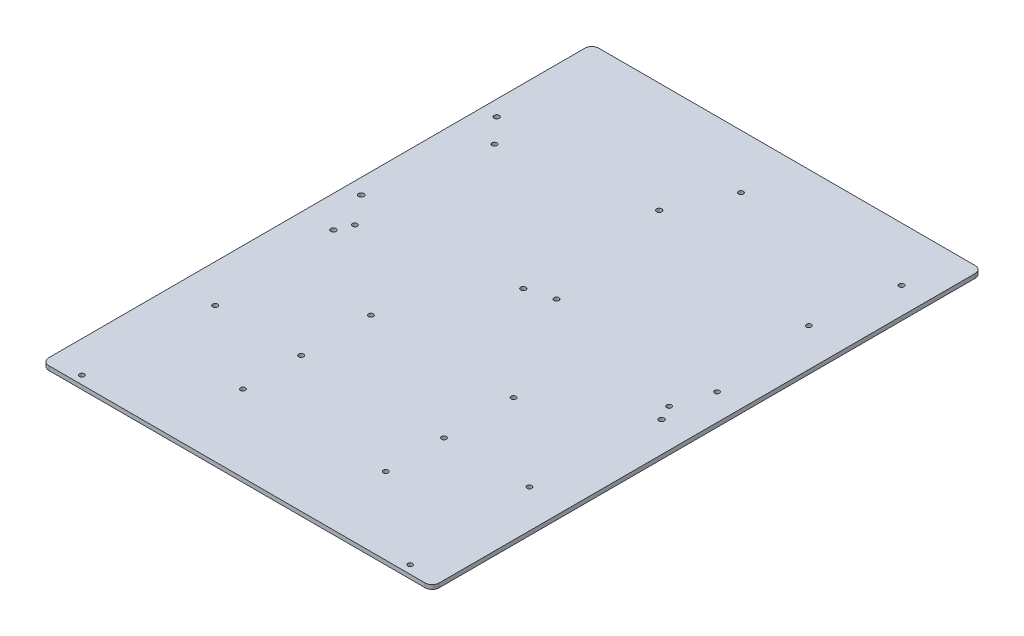
ISO-10303-21;
HEADER;
FILE_DESCRIPTION(('STEP AP214'),'2;1');
FILE_NAME('part.step','',(''),(''),'','','');
FILE_SCHEMA(('AUTOMOTIVE_DESIGN { 1 0 10303 214 1 1 1 1 }'));
ENDSEC;
DATA;
#1=APPLICATION_CONTEXT('core data for automotive mechanical design processes');
#2=APPLICATION_PROTOCOL_DEFINITION('international standard','automotive_design',2000,#1);
#3=PRODUCT_CONTEXT('',#1,'mechanical');
#4=PRODUCT('Part','Part','',(#3));
#5=PRODUCT_RELATED_PRODUCT_CATEGORY('part','',(#4));
#6=PRODUCT_DEFINITION_FORMATION('','',#4);
#7=PRODUCT_DEFINITION_CONTEXT('part definition',#1,'design');
#8=PRODUCT_DEFINITION('design','',#6,#7);
#9=PRODUCT_DEFINITION_SHAPE('','',#8);
#10=(LENGTH_UNIT() NAMED_UNIT(*) SI_UNIT(.MILLI.,.METRE.));
#11=(NAMED_UNIT(*) PLANE_ANGLE_UNIT() SI_UNIT($,.RADIAN.));
#12=(NAMED_UNIT(*) SI_UNIT($,.STERADIAN.) SOLID_ANGLE_UNIT());
#13=UNCERTAINTY_MEASURE_WITH_UNIT(LENGTH_MEASURE(1.E-05),#10,'distance_accuracy_value','');
#14=(GEOMETRIC_REPRESENTATION_CONTEXT(3) GLOBAL_UNCERTAINTY_ASSIGNED_CONTEXT((#13)) GLOBAL_UNIT_ASSIGNED_CONTEXT((#10,
#11,#12)) REPRESENTATION_CONTEXT('',''));
#15=CARTESIAN_POINT('',(0.,0.,0.));
#16=DIRECTION('',(0.,0.,1.));
#17=DIRECTION('',(1.,0.,0.));
#18=AXIS2_PLACEMENT_3D('',#15,#16,#17);
#19=CARTESIAN_POINT('',(139.7,3.,-196.85));
#20=DIRECTION('',(-1.,0.,0.));
#21=DIRECTION('',(0.,0.,1.));
#22=AXIS2_PLACEMENT_3D('',#19,#20,#21);
#23=PLANE('',#22);
#24=DIRECTION('',(0.,0.,-1.));
#25=VECTOR('',#24,1.);
#26=CARTESIAN_POINT('',(139.7,0.,-196.85));
#27=LINE('',#26,#25);
#28=CARTESIAN_POINT('',(139.7,0.,191.85));
#29=VERTEX_POINT('',#28);
#30=CARTESIAN_POINT('',(139.7,0.,-191.85));
#31=VERTEX_POINT('',#30);
#32=EDGE_CURVE('E130',#29,#31,#27,.T.);
#33=ORIENTED_EDGE('',*,*,#32,.T.);
#34=DIRECTION('',(0.,-1.,0.));
#35=VECTOR('',#34,1.);
#36=CARTESIAN_POINT('',(139.7,3.,-191.85));
#37=LINE('',#36,#35);
#38=CARTESIAN_POINT('',(139.7,3.,-191.85));
#39=VERTEX_POINT('',#38);
#40=EDGE_CURVE('E152',#31,#39,#37,.F.);
#41=ORIENTED_EDGE('',*,*,#40,.T.);
#42=DIRECTION('',(0.,0.,-1.));
#43=VECTOR('',#42,1.);
#44=CARTESIAN_POINT('',(139.7,3.,-196.85));
#45=LINE('',#44,#43);
#46=CARTESIAN_POINT('',(139.7,3.,191.85));
#47=VERTEX_POINT('',#46);
#48=EDGE_CURVE('E128',#47,#39,#45,.T.);
#49=ORIENTED_EDGE('',*,*,#48,.F.);
#50=DIRECTION('',(0.,-1.,0.));
#51=VECTOR('',#50,1.);
#52=CARTESIAN_POINT('',(139.7,3.,191.85));
#53=LINE('',#52,#51);
#54=EDGE_CURVE('E149',#47,#29,#53,.T.);
#55=ORIENTED_EDGE('',*,*,#54,.T.);
#56=EDGE_LOOP('',(#33,#41,#49,#55));
#57=FACE_BOUND('',#56,.T.);
#58=ADVANCED_FACE('F33',(#57),#23,.F.);
#59=CARTESIAN_POINT('',(-139.7,3.,-196.85));
#60=DIRECTION('',(0.,0.,1.));
#61=DIRECTION('',(1.,0.,0.));
#62=AXIS2_PLACEMENT_3D('',#59,#60,#61);
#63=PLANE('',#62);
#64=DIRECTION('',(-1.,0.,0.));
#65=VECTOR('',#64,1.);
#66=CARTESIAN_POINT('',(-139.7,0.,-196.85));
#67=LINE('',#66,#65);
#68=CARTESIAN_POINT('',(134.7,0.,-196.85));
#69=VERTEX_POINT('',#68);
#70=CARTESIAN_POINT('',(-134.7,0.,-196.85));
#71=VERTEX_POINT('',#70);
#72=EDGE_CURVE('E126',#69,#71,#67,.T.);
#73=ORIENTED_EDGE('',*,*,#72,.T.);
#74=DIRECTION('',(0.,-1.,0.));
#75=VECTOR('',#74,1.);
#76=CARTESIAN_POINT('',(-134.7,3.,-196.85));
#77=LINE('',#76,#75);
#78=CARTESIAN_POINT('',(-134.7,3.,-196.85));
#79=VERTEX_POINT('',#78);
#80=EDGE_CURVE('E104',#71,#79,#77,.F.);
#81=ORIENTED_EDGE('',*,*,#80,.T.);
#82=DIRECTION('',(-1.,0.,0.));
#83=VECTOR('',#82,1.);
#84=CARTESIAN_POINT('',(-139.7,3.,-196.85));
#85=LINE('',#84,#83);
#86=CARTESIAN_POINT('',(134.7,3.,-196.85));
#87=VERTEX_POINT('',#86);
#88=EDGE_CURVE('E166',#87,#79,#85,.T.);
#89=ORIENTED_EDGE('',*,*,#88,.F.);
#90=DIRECTION('',(0.,-1.,0.));
#91=VECTOR('',#90,1.);
#92=CARTESIAN_POINT('',(134.7,3.,-196.85));
#93=LINE('',#92,#91);
#94=EDGE_CURVE('E109',#87,#69,#93,.T.);
#95=ORIENTED_EDGE('',*,*,#94,.T.);
#96=EDGE_LOOP('',(#73,#81,#89,#95));
#97=FACE_BOUND('',#96,.T.);
#98=ADVANCED_FACE('F171',(#97),#63,.F.);
#99=CARTESIAN_POINT('',(-139.7,3.,-196.85));
#100=DIRECTION('',(1.,0.,0.));
#101=DIRECTION('',(0.,0.,-1.));
#102=AXIS2_PLACEMENT_3D('',#99,#100,#101);
#103=PLANE('',#102);
#104=DIRECTION('',(0.,0.,1.));
#105=VECTOR('',#104,1.);
#106=CARTESIAN_POINT('',(-139.7,3.,-196.85));
#107=LINE('',#106,#105);
#108=CARTESIAN_POINT('',(-139.7,3.,-191.85));
#109=VERTEX_POINT('',#108);
#110=CARTESIAN_POINT('',(-139.7,3.,191.85));
#111=VERTEX_POINT('',#110);
#112=EDGE_CURVE('E118',#109,#111,#107,.T.);
#113=ORIENTED_EDGE('',*,*,#112,.F.);
#114=DIRECTION('',(0.,-1.,0.));
#115=VECTOR('',#114,1.);
#116=CARTESIAN_POINT('',(-139.7,3.,-191.85));
#117=LINE('',#116,#115);
#118=CARTESIAN_POINT('',(-139.7,0.,-191.85));
#119=VERTEX_POINT('',#118);
#120=EDGE_CURVE('E103',#109,#119,#117,.T.);
#121=ORIENTED_EDGE('',*,*,#120,.T.);
#122=DIRECTION('',(0.,0.,1.));
#123=VECTOR('',#122,1.);
#124=CARTESIAN_POINT('',(-139.7,0.,-196.85));
#125=LINE('',#124,#123);
#126=CARTESIAN_POINT('',(-139.7,0.,191.85));
#127=VERTEX_POINT('',#126);
#128=EDGE_CURVE('E116',#119,#127,#125,.T.);
#129=ORIENTED_EDGE('',*,*,#128,.T.);
#130=DIRECTION('',(0.,-1.,0.));
#131=VECTOR('',#130,1.);
#132=CARTESIAN_POINT('',(-139.7,3.,191.85));
#133=LINE('',#132,#131);
#134=EDGE_CURVE('E120',#127,#111,#133,.F.);
#135=ORIENTED_EDGE('',*,*,#134,.T.);
#136=EDGE_LOOP('',(#113,#121,#129,#135));
#137=FACE_BOUND('',#136,.T.);
#138=ADVANCED_FACE('F115',(#137),#103,.F.);
#139=CARTESIAN_POINT('',(-139.7,3.,196.85));
#140=DIRECTION('',(0.,0.,-1.));
#141=DIRECTION('',(-1.,0.,0.));
#142=AXIS2_PLACEMENT_3D('',#139,#140,#141);
#143=PLANE('',#142);
#144=DIRECTION('',(1.,0.,0.));
#145=VECTOR('',#144,1.);
#146=CARTESIAN_POINT('',(-139.7,3.,196.85));
#147=LINE('',#146,#145);
#148=CARTESIAN_POINT('',(-134.7,3.,196.85));
#149=VERTEX_POINT('',#148);
#150=CARTESIAN_POINT('',(134.7,3.,196.85));
#151=VERTEX_POINT('',#150);
#152=EDGE_CURVE('E134',#149,#151,#147,.T.);
#153=ORIENTED_EDGE('',*,*,#152,.F.);
#154=DIRECTION('',(0.,-1.,0.));
#155=VECTOR('',#154,1.);
#156=CARTESIAN_POINT('',(-134.7,3.,196.85));
#157=LINE('',#156,#155);
#158=CARTESIAN_POINT('',(-134.7,0.,196.85));
#159=VERTEX_POINT('',#158);
#160=EDGE_CURVE('E11',#149,#159,#157,.T.);
#161=ORIENTED_EDGE('',*,*,#160,.T.);
#162=DIRECTION('',(1.,0.,0.));
#163=VECTOR('',#162,1.);
#164=CARTESIAN_POINT('',(-139.7,0.,196.85));
#165=LINE('',#164,#163);
#166=CARTESIAN_POINT('',(134.7,0.,196.85));
#167=VERTEX_POINT('',#166);
#168=EDGE_CURVE('E125',#159,#167,#165,.T.);
#169=ORIENTED_EDGE('',*,*,#168,.T.);
#170=DIRECTION('',(0.,-1.,0.));
#171=VECTOR('',#170,1.);
#172=CARTESIAN_POINT('',(134.7,3.,196.85));
#173=LINE('',#172,#171);
#174=EDGE_CURVE('E41',#167,#151,#173,.F.);
#175=ORIENTED_EDGE('',*,*,#174,.T.);
#176=EDGE_LOOP('',(#153,#161,#169,#175));
#177=FACE_BOUND('',#176,.T.);
#178=ADVANCED_FACE('F333',(#177),#143,.F.);
#179=CARTESIAN_POINT('',(0.,3.,0.));
#180=DIRECTION('',(0.,1.,0.));
#181=DIRECTION('',(0.,0.,1.));
#182=AXIS2_PLACEMENT_3D('',#179,#180,#181);
#183=PLANE('',#182);
#184=CARTESIAN_POINT('',(-50.759432206986,3.,141.855107781137));
#185=DIRECTION('',(0.,1.,0.));
#186=DIRECTION('',(0.,0.,1.));
#187=AXIS2_PLACEMENT_3D('',#184,#185,#186);
#188=CIRCLE('',#187,1.75);
#189=CARTESIAN_POINT('',(-50.759432206986,3.,143.605107781137));
#190=VERTEX_POINT('',#189);
#191=EDGE_CURVE('E303',#190,#190,#188,.T.);
#192=ORIENTED_EDGE('',*,*,#191,.F.);
#193=EDGE_LOOP('',(#192));
#194=FACE_BOUND('',#193,.T.);
#195=CARTESIAN_POINT('',(51.4560361789192,3.,50.2971763833358));
#196=DIRECTION('',(0.,1.,0.));
#197=DIRECTION('',(0.,0.,1.));
#198=AXIS2_PLACEMENT_3D('',#195,#196,#197);
#199=CIRCLE('',#198,1.75);
#200=CARTESIAN_POINT('',(51.4560361789192,3.,52.0471763833358));
#201=VERTEX_POINT('',#200);
#202=EDGE_CURVE('E310',#201,#201,#199,.T.);
#203=ORIENTED_EDGE('',*,*,#202,.F.);
#204=EDGE_LOOP('',(#203));
#205=FACE_BOUND('',#204,.T.);
#206=CARTESIAN_POINT('',(-50.759432206986,3.,50.2971763833358));
#207=DIRECTION('',(0.,1.,0.));
#208=DIRECTION('',(0.,0.,1.));
#209=AXIS2_PLACEMENT_3D('',#206,#207,#208);
#210=CIRCLE('',#209,1.75);
#211=CARTESIAN_POINT('',(-50.759432206986,3.,52.0471763833358));
#212=VERTEX_POINT('',#211);
#213=EDGE_CURVE('E291',#212,#212,#210,.T.);
#214=ORIENTED_EDGE('',*,*,#213,.F.);
#215=EDGE_LOOP('',(#214));
#216=FACE_BOUND('',#215,.T.);
#217=CARTESIAN_POINT('',(51.4560361789192,3.,100.19382682764));
#218=DIRECTION('',(0.,1.,0.));
#219=DIRECTION('',(0.,0.,1.));
#220=AXIS2_PLACEMENT_3D('',#217,#218,#219);
#221=CIRCLE('',#220,1.75);
#222=CARTESIAN_POINT('',(51.4560361789192,3.,101.94382682764));
#223=VERTEX_POINT('',#222);
#224=EDGE_CURVE('E298',#223,#223,#221,.T.);
#225=ORIENTED_EDGE('',*,*,#224,.F.);
#226=EDGE_LOOP('',(#225));
#227=FACE_BOUND('',#226,.T.);
#228=CARTESIAN_POINT('',(51.4560361789192,3.,141.855107781137));
#229=DIRECTION('',(0.,1.,0.));
#230=DIRECTION('',(0.,0.,1.));
#231=AXIS2_PLACEMENT_3D('',#228,#229,#230);
#232=CIRCLE('',#231,1.75);
#233=CARTESIAN_POINT('',(51.4560361789192,3.,143.605107781137));
#234=VERTEX_POINT('',#233);
#235=EDGE_CURVE('E315',#234,#234,#232,.T.);
#236=ORIENTED_EDGE('',*,*,#235,.F.);
#237=EDGE_LOOP('',(#236));
#238=FACE_BOUND('',#237,.T.);
#239=CARTESIAN_POINT('',(-50.759432206986,3.,100.19382682764));
#240=DIRECTION('',(0.,1.,0.));
#241=DIRECTION('',(0.,0.,1.));
#242=AXIS2_PLACEMENT_3D('',#239,#240,#241);
#243=CIRCLE('',#242,1.75);
#244=CARTESIAN_POINT('',(-50.759432206986,3.,101.94382682764));
#245=VERTEX_POINT('',#244);
#246=EDGE_CURVE('E285',#245,#245,#243,.T.);
#247=ORIENTED_EDGE('',*,*,#246,.F.);
#248=EDGE_LOOP('',(#247));
#249=FACE_BOUND('',#248,.T.);
#250=CARTESIAN_POINT('',(-112.5,3.,0.));
#251=DIRECTION('',(0.,1.,0.));
#252=DIRECTION('',(0.,0.,1.));
#253=AXIS2_PLACEMENT_3D('',#250,#251,#252);
#254=CIRCLE('',#253,1.75);
#255=CARTESIAN_POINT('',(-112.5,3.,1.75));
#256=VERTEX_POINT('',#255);
#257=EDGE_CURVE('E267',#256,#256,#254,.T.);
#258=ORIENTED_EDGE('',*,*,#257,.F.);
#259=EDGE_LOOP('',(#258));
#260=FACE_BOUND('',#259,.T.);
#261=CARTESIAN_POINT('',(112.5,3.,-100.));
#262=DIRECTION('',(0.,1.,0.));
#263=DIRECTION('',(0.,0.,1.));
#264=AXIS2_PLACEMENT_3D('',#261,#262,#263);
#265=CIRCLE('',#264,1.75);
#266=CARTESIAN_POINT('',(112.5,3.,-98.25));
#267=VERTEX_POINT('',#266);
#268=EDGE_CURVE('E274',#267,#267,#265,.T.);
#269=ORIENTED_EDGE('',*,*,#268,.F.);
#270=EDGE_LOOP('',(#269));
#271=FACE_BOUND('',#270,.T.);
#272=CARTESIAN_POINT('',(-112.5,3.,-100.));
#273=DIRECTION('',(0.,1.,0.));
#274=DIRECTION('',(0.,0.,1.));
#275=AXIS2_PLACEMENT_3D('',#272,#273,#274);
#276=CIRCLE('',#275,1.75);
#277=CARTESIAN_POINT('',(-112.5,3.,-98.25));
#278=VERTEX_POINT('',#277);
#279=EDGE_CURVE('E255',#278,#278,#276,.T.);
#280=ORIENTED_EDGE('',*,*,#279,.F.);
#281=EDGE_LOOP('',(#280));
#282=FACE_BOUND('',#281,.T.);
#283=CARTESIAN_POINT('',(112.5,3.,100.));
#284=DIRECTION('',(0.,1.,0.));
#285=DIRECTION('',(0.,0.,1.));
#286=AXIS2_PLACEMENT_3D('',#283,#284,#285);
#287=CIRCLE('',#286,1.75);
#288=CARTESIAN_POINT('',(112.5,3.,101.75));
#289=VERTEX_POINT('',#288);
#290=EDGE_CURVE('E262',#289,#289,#287,.T.);
#291=ORIENTED_EDGE('',*,*,#290,.F.);
#292=EDGE_LOOP('',(#291));
#293=FACE_BOUND('',#292,.T.);
#294=CARTESIAN_POINT('',(112.5,3.,0.));
#295=DIRECTION('',(0.,1.,0.));
#296=DIRECTION('',(0.,0.,1.));
#297=AXIS2_PLACEMENT_3D('',#294,#295,#296);
#298=CIRCLE('',#297,1.75);
#299=CARTESIAN_POINT('',(112.5,3.,1.75));
#300=VERTEX_POINT('',#299);
#301=EDGE_CURVE('E279',#300,#300,#298,.T.);
#302=ORIENTED_EDGE('',*,*,#301,.F.);
#303=EDGE_LOOP('',(#302));
#304=FACE_BOUND('',#303,.T.);
#305=CARTESIAN_POINT('',(-112.5,3.,100.));
#306=DIRECTION('',(0.,1.,0.));
#307=DIRECTION('',(0.,0.,1.));
#308=AXIS2_PLACEMENT_3D('',#305,#306,#307);
#309=CIRCLE('',#308,1.75);
#310=CARTESIAN_POINT('',(-112.5,3.,101.75));
#311=VERTEX_POINT('',#310);
#312=EDGE_CURVE('E249',#311,#311,#309,.T.);
#313=ORIENTED_EDGE('',*,*,#312,.F.);
#314=EDGE_LOOP('',(#313));
#315=FACE_BOUND('',#314,.T.);
#316=CARTESIAN_POINT('',(117.979744279708,3.,190.887260588319));
#317=DIRECTION('',(0.,1.,0.));
#318=DIRECTION('',(0.,0.,1.));
#319=AXIS2_PLACEMENT_3D('',#316,#317,#318);
#320=CIRCLE('',#319,1.70000000000001);
#321=CARTESIAN_POINT('',(117.979744279708,3.,192.587260588319));
#322=VERTEX_POINT('',#321);
#323=EDGE_CURVE('E214',#322,#322,#320,.T.);
#324=ORIENTED_EDGE('',*,*,#323,.F.);
#325=EDGE_LOOP('',(#324));
#326=FACE_BOUND('',#325,.T.);
#327=CARTESIAN_POINT('',(-117.020255720292,3.,10.887260588319));
#328=DIRECTION('',(0.,1.,0.));
#329=DIRECTION('',(0.,0.,1.));
#330=AXIS2_PLACEMENT_3D('',#327,#328,#329);
#331=CIRCLE('',#330,1.87086272133166);
#332=CARTESIAN_POINT('',(-117.020255720292,3.,12.7581233096506));
#333=VERTEX_POINT('',#332);
#334=EDGE_CURVE('E207',#333,#333,#331,.T.);
#335=ORIENTED_EDGE('',*,*,#334,.F.);
#336=EDGE_LOOP('',(#335));
#337=FACE_BOUND('',#336,.T.);
#338=CARTESIAN_POINT('',(117.979744279708,3.,10.887260588319));
#339=DIRECTION('',(0.,1.,0.));
#340=DIRECTION('',(0.,0.,1.));
#341=AXIS2_PLACEMENT_3D('',#338,#339,#340);
#342=CIRCLE('',#341,1.88331756868279);
#343=CARTESIAN_POINT('',(117.979744279708,3.,12.7705781570018));
#344=VERTEX_POINT('',#343);
#345=EDGE_CURVE('E226',#344,#344,#342,.T.);
#346=ORIENTED_EDGE('',*,*,#345,.F.);
#347=EDGE_LOOP('',(#346));
#348=FACE_BOUND('',#347,.T.);
#349=CARTESIAN_POINT('',(-128.708296927625,3.,-117.786916862652));
#350=DIRECTION('',(0.,1.,0.));
#351=DIRECTION('',(0.,0.,1.));
#352=AXIS2_PLACEMENT_3D('',#349,#350,#351);
#353=CIRCLE('',#352,1.83699596977647);
#354=CARTESIAN_POINT('',(-128.708296927625,3.,-115.949920892875));
#355=VERTEX_POINT('',#354);
#356=EDGE_CURVE('E219',#355,#355,#353,.T.);
#357=ORIENTED_EDGE('',*,*,#356,.F.);
#358=EDGE_LOOP('',(#357));
#359=FACE_BOUND('',#358,.T.);
#360=CARTESIAN_POINT('',(5.71003652236366,3.,-26.1442008502404));
#361=DIRECTION('',(0.,1.,0.));
#362=DIRECTION('',(0.,0.,1.));
#363=AXIS2_PLACEMENT_3D('',#360,#361,#362);
#364=CIRCLE('',#363,1.75);
#365=CARTESIAN_POINT('',(5.71003652236366,3.,-24.3942008502404));
#366=VERTEX_POINT('',#365);
#367=EDGE_CURVE('E183',#366,#366,#364,.T.);
#368=ORIENTED_EDGE('',*,*,#367,.F.);
#369=EDGE_LOOP('',(#368));
#370=FACE_BOUND('',#369,.T.);
#371=CARTESIAN_POINT('',(120.710036522364,3.,-26.1442008502404));
#372=DIRECTION('',(0.,1.,0.));
#373=DIRECTION('',(0.,0.,1.));
#374=AXIS2_PLACEMENT_3D('',#371,#372,#373);
#375=CIRCLE('',#374,1.75);
#376=CARTESIAN_POINT('',(120.710036522364,3.,-24.3942008502404));
#377=VERTEX_POINT('',#376);
#378=EDGE_CURVE('E190',#377,#377,#375,.T.);
#379=ORIENTED_EDGE('',*,*,#378,.F.);
#380=EDGE_LOOP('',(#379));
#381=FACE_BOUND('',#380,.T.);
#382=CARTESIAN_POINT('',(5.71003652236366,3.,-158.14420085024));
#383=DIRECTION('',(0.,1.,0.));
#384=DIRECTION('',(0.,0.,1.));
#385=AXIS2_PLACEMENT_3D('',#382,#383,#384);
#386=CIRCLE('',#385,1.75);
#387=CARTESIAN_POINT('',(5.71003652236366,3.,-156.39420085024));
#388=VERTEX_POINT('',#387);
#389=EDGE_CURVE('E196',#388,#388,#386,.T.);
#390=ORIENTED_EDGE('',*,*,#389,.F.);
#391=EDGE_LOOP('',(#390));
#392=FACE_BOUND('',#391,.T.);
#393=CARTESIAN_POINT('',(120.710036522364,3.,-158.14420085024));
#394=DIRECTION('',(0.,1.,0.));
#395=DIRECTION('',(0.,0.,1.));
#396=AXIS2_PLACEMENT_3D('',#393,#394,#395);
#397=CIRCLE('',#396,1.75);
#398=CARTESIAN_POINT('',(120.710036522364,3.,-156.39420085024));
#399=VERTEX_POINT('',#398);
#400=EDGE_CURVE('E202',#399,#399,#397,.T.);
#401=ORIENTED_EDGE('',*,*,#400,.F.);
#402=EDGE_LOOP('',(#401));
#403=FACE_BOUND('',#402,.T.);
#404=CARTESIAN_POINT('',(-128.708296927625,3.,-20.7869168626518));
#405=DIRECTION('',(0.,1.,0.));
#406=DIRECTION('',(0.,0.,1.));
#407=AXIS2_PLACEMENT_3D('',#404,#405,#406);
#408=CIRCLE('',#407,1.92420591097321);
#409=CARTESIAN_POINT('',(-128.708296927625,3.,-18.8627109516786));
#410=VERTEX_POINT('',#409);
#411=EDGE_CURVE('E244',#410,#410,#408,.T.);
#412=ORIENTED_EDGE('',*,*,#411,.F.);
#413=EDGE_LOOP('',(#412));
#414=FACE_BOUND('',#413,.T.);
#415=CARTESIAN_POINT('',(-12.7082969276247,3.,-20.7869168626518));
#416=DIRECTION('',(0.,1.,0.));
#417=DIRECTION('',(0.,0.,1.));
#418=AXIS2_PLACEMENT_3D('',#415,#416,#417);
#419=CIRCLE('',#418,1.84703512252406);
#420=CARTESIAN_POINT('',(-12.7082969276247,3.,-18.9398817401277));
#421=VERTEX_POINT('',#420);
#422=EDGE_CURVE('E238',#421,#421,#419,.T.);
#423=ORIENTED_EDGE('',*,*,#422,.F.);
#424=EDGE_LOOP('',(#423));
#425=FACE_BOUND('',#424,.T.);
#426=CARTESIAN_POINT('',(-12.5746244604759,3.,-117.920589329801));
#427=DIRECTION('',(0.,1.,0.));
#428=DIRECTION('',(0.,0.,1.));
#429=AXIS2_PLACEMENT_3D('',#426,#427,#428);
#430=CIRCLE('',#429,1.86155666012901);
#431=CARTESIAN_POINT('',(-12.5746244604759,3.,-116.059032669672));
#432=VERTEX_POINT('',#431);
#433=EDGE_CURVE('E231',#432,#432,#430,.T.);
#434=ORIENTED_EDGE('',*,*,#433,.F.);
#435=EDGE_LOOP('',(#434));
#436=FACE_BOUND('',#435,.T.);
#437=CARTESIAN_POINT('',(-117.020255720292,3.,190.887260588319));
#438=DIRECTION('',(0.,1.,0.));
#439=DIRECTION('',(0.,0.,1.));
#440=AXIS2_PLACEMENT_3D('',#437,#438,#439);
#441=CIRCLE('',#440,1.71604989045369);
#442=CARTESIAN_POINT('',(-117.020255720292,3.,192.603310478773));
#443=VERTEX_POINT('',#442);
#444=EDGE_CURVE('E174',#443,#443,#441,.T.);
#445=ORIENTED_EDGE('',*,*,#444,.F.);
#446=EDGE_LOOP('',(#445));
#447=FACE_BOUND('',#446,.T.);
#448=ORIENTED_EDGE('',*,*,#88,.T.);
#449=CARTESIAN_POINT('',(-134.7,3.,-191.85));
#450=DIRECTION('',(0.,1.,0.));
#451=DIRECTION('',(0.,0.,1.));
#452=AXIS2_PLACEMENT_3D('',#449,#450,#451);
#453=CIRCLE('',#452,5.);
#454=EDGE_CURVE('E147',#79,#109,#453,.T.);
#455=ORIENTED_EDGE('',*,*,#454,.T.);
#456=ORIENTED_EDGE('',*,*,#112,.T.);
#457=CARTESIAN_POINT('',(-134.7,3.,191.85));
#458=DIRECTION('',(0.,1.,0.));
#459=DIRECTION('',(0.,0.,1.));
#460=AXIS2_PLACEMENT_3D('',#457,#458,#459);
#461=CIRCLE('',#460,5.);
#462=EDGE_CURVE('E54',#111,#149,#461,.T.);
#463=ORIENTED_EDGE('',*,*,#462,.T.);
#464=ORIENTED_EDGE('',*,*,#152,.T.);
#465=CARTESIAN_POINT('',(134.7,3.,191.85));
#466=DIRECTION('',(0.,1.,0.));
#467=DIRECTION('',(0.,0.,1.));
#468=AXIS2_PLACEMENT_3D('',#465,#466,#467);
#469=CIRCLE('',#468,5.);
#470=EDGE_CURVE('E142',#151,#47,#469,.T.);
#471=ORIENTED_EDGE('',*,*,#470,.T.);
#472=ORIENTED_EDGE('',*,*,#48,.T.);
#473=CARTESIAN_POINT('',(134.7,3.,-191.85));
#474=DIRECTION('',(0.,1.,0.));
#475=DIRECTION('',(0.,0.,1.));
#476=AXIS2_PLACEMENT_3D('',#473,#474,#475);
#477=CIRCLE('',#476,5.);
#478=EDGE_CURVE('E145',#39,#87,#477,.T.);
#479=ORIENTED_EDGE('',*,*,#478,.T.);
#480=EDGE_LOOP('',(#448,#455,#456,#463,#464,#471,#472,#479));
#481=FACE_BOUND('',#480,.T.);
#482=ADVANCED_FACE('F163',(#194,#205,#216,#227,#238,#249,#260,#271,#282,#293,#304,#315,#326,
#337,#348,#359,#370,#381,#392,#403,#414,#425,#436,#447,#481),#183,.T.);
#483=CARTESIAN_POINT('',(0.,0.,0.));
#484=DIRECTION('',(0.,1.,0.));
#485=DIRECTION('',(0.,0.,1.));
#486=AXIS2_PLACEMENT_3D('',#483,#484,#485);
#487=PLANE('',#486);
#488=CARTESIAN_POINT('',(-50.759432206986,0.,141.855107781137));
#489=DIRECTION('',(0.,1.,0.));
#490=DIRECTION('',(0.,0.,1.));
#491=AXIS2_PLACEMENT_3D('',#488,#489,#490);
#492=CIRCLE('',#491,1.75);
#493=CARTESIAN_POINT('',(-50.759432206986,0.,143.605107781137));
#494=VERTEX_POINT('',#493);
#495=EDGE_CURVE('E306',#494,#494,#492,.T.);
#496=ORIENTED_EDGE('',*,*,#495,.T.);
#497=EDGE_LOOP('',(#496));
#498=FACE_BOUND('',#497,.T.);
#499=CARTESIAN_POINT('',(51.4560361789192,0.,50.2971763833358));
#500=DIRECTION('',(0.,1.,0.));
#501=DIRECTION('',(0.,0.,1.));
#502=AXIS2_PLACEMENT_3D('',#499,#500,#501);
#503=CIRCLE('',#502,1.75);
#504=CARTESIAN_POINT('',(51.4560361789192,0.,52.0471763833358));
#505=VERTEX_POINT('',#504);
#506=EDGE_CURVE('E295',#505,#505,#503,.T.);
#507=ORIENTED_EDGE('',*,*,#506,.T.);
#508=EDGE_LOOP('',(#507));
#509=FACE_BOUND('',#508,.T.);
#510=CARTESIAN_POINT('',(-50.759432206986,0.,50.2971763833358));
#511=DIRECTION('',(0.,1.,0.));
#512=DIRECTION('',(0.,0.,1.));
#513=AXIS2_PLACEMENT_3D('',#510,#511,#512);
#514=CIRCLE('',#513,1.75);
#515=CARTESIAN_POINT('',(-50.759432206986,0.,52.0471763833358));
#516=VERTEX_POINT('',#515);
#517=EDGE_CURVE('E294',#516,#516,#514,.T.);
#518=ORIENTED_EDGE('',*,*,#517,.T.);
#519=EDGE_LOOP('',(#518));
#520=FACE_BOUND('',#519,.T.);
#521=CARTESIAN_POINT('',(51.4560361789192,0.,100.19382682764));
#522=DIRECTION('',(0.,1.,0.));
#523=DIRECTION('',(0.,0.,1.));
#524=AXIS2_PLACEMENT_3D('',#521,#522,#523);
#525=CIRCLE('',#524,1.75);
#526=CARTESIAN_POINT('',(51.4560361789192,0.,101.94382682764));
#527=VERTEX_POINT('',#526);
#528=EDGE_CURVE('E288',#527,#527,#525,.T.);
#529=ORIENTED_EDGE('',*,*,#528,.T.);
#530=EDGE_LOOP('',(#529));
#531=FACE_BOUND('',#530,.T.);
#532=CARTESIAN_POINT('',(51.4560361789192,0.,141.855107781137));
#533=DIRECTION('',(0.,1.,0.));
#534=DIRECTION('',(0.,0.,1.));
#535=AXIS2_PLACEMENT_3D('',#532,#533,#534);
#536=CIRCLE('',#535,1.75);
#537=CARTESIAN_POINT('',(51.4560361789192,0.,143.605107781137));
#538=VERTEX_POINT('',#537);
#539=EDGE_CURVE('E307',#538,#538,#536,.T.);
#540=ORIENTED_EDGE('',*,*,#539,.T.);
#541=EDGE_LOOP('',(#540));
#542=FACE_BOUND('',#541,.T.);
#543=CARTESIAN_POINT('',(-50.759432206986,0.,100.19382682764));
#544=DIRECTION('',(0.,1.,0.));
#545=DIRECTION('',(0.,0.,1.));
#546=AXIS2_PLACEMENT_3D('',#543,#544,#545);
#547=CIRCLE('',#546,1.75);
#548=CARTESIAN_POINT('',(-50.759432206986,0.,101.94382682764));
#549=VERTEX_POINT('',#548);
#550=EDGE_CURVE('E282',#549,#549,#547,.T.);
#551=ORIENTED_EDGE('',*,*,#550,.T.);
#552=EDGE_LOOP('',(#551));
#553=FACE_BOUND('',#552,.T.);
#554=CARTESIAN_POINT('',(-112.5,0.,0.));
#555=DIRECTION('',(0.,1.,0.));
#556=DIRECTION('',(0.,0.,1.));
#557=AXIS2_PLACEMENT_3D('',#554,#555,#556);
#558=CIRCLE('',#557,1.75);
#559=CARTESIAN_POINT('',(-112.5,0.,1.75));
#560=VERTEX_POINT('',#559);
#561=EDGE_CURVE('E270',#560,#560,#558,.T.);
#562=ORIENTED_EDGE('',*,*,#561,.T.);
#563=EDGE_LOOP('',(#562));
#564=FACE_BOUND('',#563,.T.);
#565=CARTESIAN_POINT('',(112.5,0.,-100.));
#566=DIRECTION('',(0.,1.,0.));
#567=DIRECTION('',(0.,0.,1.));
#568=AXIS2_PLACEMENT_3D('',#565,#566,#567);
#569=CIRCLE('',#568,1.75);
#570=CARTESIAN_POINT('',(112.5,0.,-98.25));
#571=VERTEX_POINT('',#570);
#572=EDGE_CURVE('E259',#571,#571,#569,.T.);
#573=ORIENTED_EDGE('',*,*,#572,.T.);
#574=EDGE_LOOP('',(#573));
#575=FACE_BOUND('',#574,.T.);
#576=CARTESIAN_POINT('',(-112.5,0.,-100.));
#577=DIRECTION('',(0.,1.,0.));
#578=DIRECTION('',(0.,0.,1.));
#579=AXIS2_PLACEMENT_3D('',#576,#577,#578);
#580=CIRCLE('',#579,1.75);
#581=CARTESIAN_POINT('',(-112.5,0.,-98.25));
#582=VERTEX_POINT('',#581);
#583=EDGE_CURVE('E258',#582,#582,#580,.T.);
#584=ORIENTED_EDGE('',*,*,#583,.T.);
#585=EDGE_LOOP('',(#584));
#586=FACE_BOUND('',#585,.T.);
#587=CARTESIAN_POINT('',(112.5,0.,100.));
#588=DIRECTION('',(0.,1.,0.));
#589=DIRECTION('',(0.,0.,1.));
#590=AXIS2_PLACEMENT_3D('',#587,#588,#589);
#591=CIRCLE('',#590,1.75);
#592=CARTESIAN_POINT('',(112.5,0.,101.75));
#593=VERTEX_POINT('',#592);
#594=EDGE_CURVE('E252',#593,#593,#591,.T.);
#595=ORIENTED_EDGE('',*,*,#594,.T.);
#596=EDGE_LOOP('',(#595));
#597=FACE_BOUND('',#596,.T.);
#598=CARTESIAN_POINT('',(112.5,0.,0.));
#599=DIRECTION('',(0.,1.,0.));
#600=DIRECTION('',(0.,0.,1.));
#601=AXIS2_PLACEMENT_3D('',#598,#599,#600);
#602=CIRCLE('',#601,1.75);
#603=CARTESIAN_POINT('',(112.5,0.,1.75));
#604=VERTEX_POINT('',#603);
#605=EDGE_CURVE('E271',#604,#604,#602,.T.);
#606=ORIENTED_EDGE('',*,*,#605,.T.);
#607=EDGE_LOOP('',(#606));
#608=FACE_BOUND('',#607,.T.);
#609=CARTESIAN_POINT('',(-112.5,0.,100.));
#610=DIRECTION('',(0.,1.,0.));
#611=DIRECTION('',(0.,0.,1.));
#612=AXIS2_PLACEMENT_3D('',#609,#610,#611);
#613=CIRCLE('',#612,1.75);
#614=CARTESIAN_POINT('',(-112.5,0.,101.75));
#615=VERTEX_POINT('',#614);
#616=EDGE_CURVE('E235',#615,#615,#613,.T.);
#617=ORIENTED_EDGE('',*,*,#616,.T.);
#618=EDGE_LOOP('',(#617));
#619=FACE_BOUND('',#618,.T.);
#620=CARTESIAN_POINT('',(117.979744279708,0.,190.887260588319));
#621=DIRECTION('',(0.,1.,0.));
#622=DIRECTION('',(0.,0.,1.));
#623=AXIS2_PLACEMENT_3D('',#620,#621,#622);
#624=CIRCLE('',#623,1.70000000000001);
#625=CARTESIAN_POINT('',(117.979744279708,0.,192.587260588319));
#626=VERTEX_POINT('',#625);
#627=EDGE_CURVE('E187',#626,#626,#624,.T.);
#628=ORIENTED_EDGE('',*,*,#627,.T.);
#629=EDGE_LOOP('',(#628));
#630=FACE_BOUND('',#629,.T.);
#631=CARTESIAN_POINT('',(-117.020255720292,0.,10.887260588319));
#632=DIRECTION('',(0.,1.,0.));
#633=DIRECTION('',(0.,0.,1.));
#634=AXIS2_PLACEMENT_3D('',#631,#632,#633);
#635=CIRCLE('',#634,1.87086272133166);
#636=CARTESIAN_POINT('',(-117.020255720292,0.,12.7581233096506));
#637=VERTEX_POINT('',#636);
#638=EDGE_CURVE('E210',#637,#637,#635,.T.);
#639=ORIENTED_EDGE('',*,*,#638,.T.);
#640=EDGE_LOOP('',(#639));
#641=FACE_BOUND('',#640,.T.);
#642=CARTESIAN_POINT('',(117.979744279708,0.,10.887260588319));
#643=DIRECTION('',(0.,1.,0.));
#644=DIRECTION('',(0.,0.,1.));
#645=AXIS2_PLACEMENT_3D('',#642,#643,#644);
#646=CIRCLE('',#645,1.88331756868279);
#647=CARTESIAN_POINT('',(117.979744279708,0.,12.7705781570018));
#648=VERTEX_POINT('',#647);
#649=EDGE_CURVE('E211',#648,#648,#646,.T.);
#650=ORIENTED_EDGE('',*,*,#649,.T.);
#651=EDGE_LOOP('',(#650));
#652=FACE_BOUND('',#651,.T.);
#653=CARTESIAN_POINT('',(-128.708296927625,0.,-117.786916862652));
#654=DIRECTION('',(0.,1.,0.));
#655=DIRECTION('',(0.,0.,1.));
#656=AXIS2_PLACEMENT_3D('',#653,#654,#655);
#657=CIRCLE('',#656,1.83699596977647);
#658=CARTESIAN_POINT('',(-128.708296927625,0.,-115.949920892875));
#659=VERTEX_POINT('',#658);
#660=EDGE_CURVE('E222',#659,#659,#657,.T.);
#661=ORIENTED_EDGE('',*,*,#660,.T.);
#662=EDGE_LOOP('',(#661));
#663=FACE_BOUND('',#662,.T.);
#664=CARTESIAN_POINT('',(5.71003652236366,0.,-26.1442008502404));
#665=DIRECTION('',(0.,1.,0.));
#666=DIRECTION('',(0.,0.,1.));
#667=AXIS2_PLACEMENT_3D('',#664,#665,#666);
#668=CIRCLE('',#667,1.75);
#669=CARTESIAN_POINT('',(5.71003652236366,0.,-24.3942008502404));
#670=VERTEX_POINT('',#669);
#671=EDGE_CURVE('E186',#670,#670,#668,.T.);
#672=ORIENTED_EDGE('',*,*,#671,.T.);
#673=EDGE_LOOP('',(#672));
#674=FACE_BOUND('',#673,.T.);
#675=CARTESIAN_POINT('',(120.710036522364,0.,-26.1442008502404));
#676=DIRECTION('',(0.,1.,0.));
#677=DIRECTION('',(0.,0.,1.));
#678=AXIS2_PLACEMENT_3D('',#675,#676,#677);
#679=CIRCLE('',#678,1.75);
#680=CARTESIAN_POINT('',(120.710036522364,0.,-24.3942008502404));
#681=VERTEX_POINT('',#680);
#682=EDGE_CURVE('E193',#681,#681,#679,.T.);
#683=ORIENTED_EDGE('',*,*,#682,.T.);
#684=EDGE_LOOP('',(#683));
#685=FACE_BOUND('',#684,.T.);
#686=CARTESIAN_POINT('',(5.71003652236366,0.,-158.14420085024));
#687=DIRECTION('',(0.,1.,0.));
#688=DIRECTION('',(0.,0.,1.));
#689=AXIS2_PLACEMENT_3D('',#686,#687,#688);
#690=CIRCLE('',#689,1.75);
#691=CARTESIAN_POINT('',(5.71003652236366,0.,-156.39420085024));
#692=VERTEX_POINT('',#691);
#693=EDGE_CURVE('E199',#692,#692,#690,.T.);
#694=ORIENTED_EDGE('',*,*,#693,.T.);
#695=EDGE_LOOP('',(#694));
#696=FACE_BOUND('',#695,.T.);
#697=CARTESIAN_POINT('',(120.710036522364,0.,-158.14420085024));
#698=DIRECTION('',(0.,1.,0.));
#699=DIRECTION('',(0.,0.,1.));
#700=AXIS2_PLACEMENT_3D('',#697,#698,#699);
#701=CIRCLE('',#700,1.75);
#702=CARTESIAN_POINT('',(120.710036522364,0.,-156.39420085024));
#703=VERTEX_POINT('',#702);
#704=EDGE_CURVE('E181',#703,#703,#701,.T.);
#705=ORIENTED_EDGE('',*,*,#704,.T.);
#706=EDGE_LOOP('',(#705));
#707=FACE_BOUND('',#706,.T.);
#708=CARTESIAN_POINT('',(-128.708296927625,0.,-20.7869168626518));
#709=DIRECTION('',(0.,1.,0.));
#710=DIRECTION('',(0.,0.,1.));
#711=AXIS2_PLACEMENT_3D('',#708,#709,#710);
#712=CIRCLE('',#711,1.92420591097321);
#713=CARTESIAN_POINT('',(-128.708296927625,0.,-18.8627109516786));
#714=VERTEX_POINT('',#713);
#715=EDGE_CURVE('E223',#714,#714,#712,.T.);
#716=ORIENTED_EDGE('',*,*,#715,.T.);
#717=EDGE_LOOP('',(#716));
#718=FACE_BOUND('',#717,.T.);
#719=CARTESIAN_POINT('',(-12.7082969276247,0.,-20.7869168626518));
#720=DIRECTION('',(0.,1.,0.));
#721=DIRECTION('',(0.,0.,1.));
#722=AXIS2_PLACEMENT_3D('',#719,#720,#721);
#723=CIRCLE('',#722,1.84703512252406);
#724=CARTESIAN_POINT('',(-12.7082969276247,0.,-18.9398817401277));
#725=VERTEX_POINT('',#724);
#726=EDGE_CURVE('E241',#725,#725,#723,.T.);
#727=ORIENTED_EDGE('',*,*,#726,.T.);
#728=EDGE_LOOP('',(#727));
#729=FACE_BOUND('',#728,.T.);
#730=CARTESIAN_POINT('',(-12.5746244604759,0.,-117.920589329801));
#731=DIRECTION('',(0.,1.,0.));
#732=DIRECTION('',(0.,0.,1.));
#733=AXIS2_PLACEMENT_3D('',#730,#731,#732);
#734=CIRCLE('',#733,1.86155666012901);
#735=CARTESIAN_POINT('',(-12.5746244604759,0.,-116.059032669672));
#736=VERTEX_POINT('',#735);
#737=EDGE_CURVE('E234',#736,#736,#734,.T.);
#738=ORIENTED_EDGE('',*,*,#737,.T.);
#739=EDGE_LOOP('',(#738));
#740=FACE_BOUND('',#739,.T.);
#741=CARTESIAN_POINT('',(-117.020255720292,0.,190.887260588319));
#742=DIRECTION('',(0.,1.,0.));
#743=DIRECTION('',(0.,0.,1.));
#744=AXIS2_PLACEMENT_3D('',#741,#742,#743);
#745=CIRCLE('',#744,1.71604989045369);
#746=CARTESIAN_POINT('',(-117.020255720292,0.,192.603310478773));
#747=VERTEX_POINT('',#746);
#748=EDGE_CURVE('E172',#747,#747,#745,.T.);
#749=ORIENTED_EDGE('',*,*,#748,.T.);
#750=EDGE_LOOP('',(#749));
#751=FACE_BOUND('',#750,.T.);
#752=ORIENTED_EDGE('',*,*,#128,.F.);
#753=CARTESIAN_POINT('',(-134.7,0.,-191.85));
#754=DIRECTION('',(0.,1.,0.));
#755=DIRECTION('',(0.,0.,1.));
#756=AXIS2_PLACEMENT_3D('',#753,#754,#755);
#757=CIRCLE('',#756,5.);
#758=EDGE_CURVE('E99',#119,#71,#757,.F.);
#759=ORIENTED_EDGE('',*,*,#758,.T.);
#760=ORIENTED_EDGE('',*,*,#72,.F.);
#761=CARTESIAN_POINT('',(134.7,0.,-191.85));
#762=DIRECTION('',(0.,1.,0.));
#763=DIRECTION('',(0.,0.,1.));
#764=AXIS2_PLACEMENT_3D('',#761,#762,#763);
#765=CIRCLE('',#764,5.);
#766=EDGE_CURVE('E110',#69,#31,#765,.F.);
#767=ORIENTED_EDGE('',*,*,#766,.T.);
#768=ORIENTED_EDGE('',*,*,#32,.F.);
#769=CARTESIAN_POINT('',(134.7,0.,191.85));
#770=DIRECTION('',(0.,1.,0.));
#771=DIRECTION('',(0.,0.,1.));
#772=AXIS2_PLACEMENT_3D('',#769,#770,#771);
#773=CIRCLE('',#772,5.);
#774=EDGE_CURVE('E119',#29,#167,#773,.F.);
#775=ORIENTED_EDGE('',*,*,#774,.T.);
#776=ORIENTED_EDGE('',*,*,#168,.F.);
#777=CARTESIAN_POINT('',(-134.7,0.,191.85));
#778=DIRECTION('',(0.,1.,0.));
#779=DIRECTION('',(0.,0.,1.));
#780=AXIS2_PLACEMENT_3D('',#777,#778,#779);
#781=CIRCLE('',#780,5.);
#782=EDGE_CURVE('E124',#159,#127,#781,.F.);
#783=ORIENTED_EDGE('',*,*,#782,.T.);
#784=EDGE_LOOP('',(#752,#759,#760,#767,#768,#775,#776,#783));
#785=FACE_BOUND('',#784,.T.);
#786=ADVANCED_FACE('F122',(#498,#509,#520,#531,#542,#553,#564,#575,#586,#597,#608,#619,#630,
#641,#652,#663,#674,#685,#696,#707,#718,#729,#740,#751,#785),#487,.F.);
#787=CARTESIAN_POINT('',(-117.020255720292,0.,190.887260588319));
#788=DIRECTION('',(0.,1.,0.));
#789=DIRECTION('',(0.,0.,1.));
#790=AXIS2_PLACEMENT_3D('',#787,#788,#789);
#791=CYLINDRICAL_SURFACE('',#790,1.71604989045369);
#792=ORIENTED_EDGE('',*,*,#748,.F.);
#793=EDGE_LOOP('',(#792));
#794=FACE_BOUND('',#793,.T.);
#795=ORIENTED_EDGE('',*,*,#444,.T.);
#796=EDGE_LOOP('',(#795));
#797=FACE_BOUND('',#796,.T.);
#798=ADVANCED_FACE('F374',(#794,#797),#791,.F.);
#799=CARTESIAN_POINT('',(-12.5746244604759,0.,-117.920589329801));
#800=DIRECTION('',(0.,1.,0.));
#801=DIRECTION('',(0.,0.,1.));
#802=AXIS2_PLACEMENT_3D('',#799,#800,#801);
#803=CYLINDRICAL_SURFACE('',#802,1.86155666012901);
#804=ORIENTED_EDGE('',*,*,#737,.F.);
#805=EDGE_LOOP('',(#804));
#806=FACE_BOUND('',#805,.T.);
#807=ORIENTED_EDGE('',*,*,#433,.T.);
#808=EDGE_LOOP('',(#807));
#809=FACE_BOUND('',#808,.T.);
#810=ADVANCED_FACE('F376',(#806,#809),#803,.F.);
#811=CARTESIAN_POINT('',(-12.7082969276247,0.,-20.7869168626518));
#812=DIRECTION('',(0.,1.,0.));
#813=DIRECTION('',(0.,0.,1.));
#814=AXIS2_PLACEMENT_3D('',#811,#812,#813);
#815=CYLINDRICAL_SURFACE('',#814,1.84703512252406);
#816=ORIENTED_EDGE('',*,*,#726,.F.);
#817=EDGE_LOOP('',(#816));
#818=FACE_BOUND('',#817,.T.);
#819=ORIENTED_EDGE('',*,*,#422,.T.);
#820=EDGE_LOOP('',(#819));
#821=FACE_BOUND('',#820,.T.);
#822=ADVANCED_FACE('F383',(#818,#821),#815,.F.);
#823=CARTESIAN_POINT('',(-128.708296927625,0.,-20.7869168626518));
#824=DIRECTION('',(0.,1.,0.));
#825=DIRECTION('',(0.,0.,1.));
#826=AXIS2_PLACEMENT_3D('',#823,#824,#825);
#827=CYLINDRICAL_SURFACE('',#826,1.92420591097321);
#828=ORIENTED_EDGE('',*,*,#715,.F.);
#829=EDGE_LOOP('',(#828));
#830=FACE_BOUND('',#829,.T.);
#831=ORIENTED_EDGE('',*,*,#411,.T.);
#832=EDGE_LOOP('',(#831));
#833=FACE_BOUND('',#832,.T.);
#834=ADVANCED_FACE('F461',(#830,#833),#827,.F.);
#835=CARTESIAN_POINT('',(120.710036522364,0.,-158.14420085024));
#836=DIRECTION('',(0.,1.,0.));
#837=DIRECTION('',(0.,0.,1.));
#838=AXIS2_PLACEMENT_3D('',#835,#836,#837);
#839=CYLINDRICAL_SURFACE('',#838,1.75);
#840=ORIENTED_EDGE('',*,*,#704,.F.);
#841=EDGE_LOOP('',(#840));
#842=FACE_BOUND('',#841,.T.);
#843=ORIENTED_EDGE('',*,*,#400,.T.);
#844=EDGE_LOOP('',(#843));
#845=FACE_BOUND('',#844,.T.);
#846=ADVANCED_FACE('F470',(#842,#845),#839,.F.);
#847=CARTESIAN_POINT('',(5.71003652236366,0.,-158.14420085024));
#848=DIRECTION('',(0.,1.,0.));
#849=DIRECTION('',(0.,0.,1.));
#850=AXIS2_PLACEMENT_3D('',#847,#848,#849);
#851=CYLINDRICAL_SURFACE('',#850,1.75);
#852=ORIENTED_EDGE('',*,*,#693,.F.);
#853=EDGE_LOOP('',(#852));
#854=FACE_BOUND('',#853,.T.);
#855=ORIENTED_EDGE('',*,*,#389,.T.);
#856=EDGE_LOOP('',(#855));
#857=FACE_BOUND('',#856,.T.);
#858=ADVANCED_FACE('F479',(#854,#857),#851,.F.);
#859=CARTESIAN_POINT('',(120.710036522364,0.,-26.1442008502404));
#860=DIRECTION('',(0.,1.,0.));
#861=DIRECTION('',(0.,0.,1.));
#862=AXIS2_PLACEMENT_3D('',#859,#860,#861);
#863=CYLINDRICAL_SURFACE('',#862,1.75);
#864=ORIENTED_EDGE('',*,*,#682,.F.);
#865=EDGE_LOOP('',(#864));
#866=FACE_BOUND('',#865,.T.);
#867=ORIENTED_EDGE('',*,*,#378,.T.);
#868=EDGE_LOOP('',(#867));
#869=FACE_BOUND('',#868,.T.);
#870=ADVANCED_FACE('F488',(#866,#869),#863,.F.);
#871=CARTESIAN_POINT('',(5.71003652236366,0.,-26.1442008502404));
#872=DIRECTION('',(0.,1.,0.));
#873=DIRECTION('',(0.,0.,1.));
#874=AXIS2_PLACEMENT_3D('',#871,#872,#873);
#875=CYLINDRICAL_SURFACE('',#874,1.75);
#876=ORIENTED_EDGE('',*,*,#671,.F.);
#877=EDGE_LOOP('',(#876));
#878=FACE_BOUND('',#877,.T.);
#879=ORIENTED_EDGE('',*,*,#367,.T.);
#880=EDGE_LOOP('',(#879));
#881=FACE_BOUND('',#880,.T.);
#882=ADVANCED_FACE('F497',(#878,#881),#875,.F.);
#883=CARTESIAN_POINT('',(-128.708296927625,0.,-117.786916862652));
#884=DIRECTION('',(0.,1.,0.));
#885=DIRECTION('',(0.,0.,1.));
#886=AXIS2_PLACEMENT_3D('',#883,#884,#885);
#887=CYLINDRICAL_SURFACE('',#886,1.83699596977647);
#888=ORIENTED_EDGE('',*,*,#660,.F.);
#889=EDGE_LOOP('',(#888));
#890=FACE_BOUND('',#889,.T.);
#891=ORIENTED_EDGE('',*,*,#356,.T.);
#892=EDGE_LOOP('',(#891));
#893=FACE_BOUND('',#892,.T.);
#894=ADVANCED_FACE('F506',(#890,#893),#887,.F.);
#895=CARTESIAN_POINT('',(117.979744279708,0.,10.887260588319));
#896=DIRECTION('',(0.,1.,0.));
#897=DIRECTION('',(0.,0.,1.));
#898=AXIS2_PLACEMENT_3D('',#895,#896,#897);
#899=CYLINDRICAL_SURFACE('',#898,1.88331756868279);
#900=ORIENTED_EDGE('',*,*,#649,.F.);
#901=EDGE_LOOP('',(#900));
#902=FACE_BOUND('',#901,.T.);
#903=ORIENTED_EDGE('',*,*,#345,.T.);
#904=EDGE_LOOP('',(#903));
#905=FACE_BOUND('',#904,.T.);
#906=ADVANCED_FACE('F514',(#902,#905),#899,.F.);
#907=CARTESIAN_POINT('',(-117.020255720292,0.,10.887260588319));
#908=DIRECTION('',(0.,1.,0.));
#909=DIRECTION('',(0.,0.,1.));
#910=AXIS2_PLACEMENT_3D('',#907,#908,#909);
#911=CYLINDRICAL_SURFACE('',#910,1.87086272133166);
#912=ORIENTED_EDGE('',*,*,#638,.F.);
#913=EDGE_LOOP('',(#912));
#914=FACE_BOUND('',#913,.T.);
#915=ORIENTED_EDGE('',*,*,#334,.T.);
#916=EDGE_LOOP('',(#915));
#917=FACE_BOUND('',#916,.T.);
#918=ADVANCED_FACE('F523',(#914,#917),#911,.F.);
#919=CARTESIAN_POINT('',(117.979744279708,0.,190.887260588319));
#920=DIRECTION('',(0.,1.,0.));
#921=DIRECTION('',(0.,0.,1.));
#922=AXIS2_PLACEMENT_3D('',#919,#920,#921);
#923=CYLINDRICAL_SURFACE('',#922,1.70000000000001);
#924=ORIENTED_EDGE('',*,*,#627,.F.);
#925=EDGE_LOOP('',(#924));
#926=FACE_BOUND('',#925,.T.);
#927=ORIENTED_EDGE('',*,*,#323,.T.);
#928=EDGE_LOOP('',(#927));
#929=FACE_BOUND('',#928,.T.);
#930=ADVANCED_FACE('F532',(#926,#929),#923,.F.);
#931=CARTESIAN_POINT('',(-112.5,0.,100.));
#932=DIRECTION('',(0.,1.,0.));
#933=DIRECTION('',(0.,0.,1.));
#934=AXIS2_PLACEMENT_3D('',#931,#932,#933);
#935=CYLINDRICAL_SURFACE('',#934,1.75);
#936=ORIENTED_EDGE('',*,*,#616,.F.);
#937=EDGE_LOOP('',(#936));
#938=FACE_BOUND('',#937,.T.);
#939=ORIENTED_EDGE('',*,*,#312,.T.);
#940=EDGE_LOOP('',(#939));
#941=FACE_BOUND('',#940,.T.);
#942=ADVANCED_FACE('F541',(#938,#941),#935,.F.);
#943=CARTESIAN_POINT('',(112.5,0.,0.));
#944=DIRECTION('',(0.,1.,0.));
#945=DIRECTION('',(0.,0.,1.));
#946=AXIS2_PLACEMENT_3D('',#943,#944,#945);
#947=CYLINDRICAL_SURFACE('',#946,1.75);
#948=ORIENTED_EDGE('',*,*,#605,.F.);
#949=EDGE_LOOP('',(#948));
#950=FACE_BOUND('',#949,.T.);
#951=ORIENTED_EDGE('',*,*,#301,.T.);
#952=EDGE_LOOP('',(#951));
#953=FACE_BOUND('',#952,.T.);
#954=ADVANCED_FACE('F550',(#950,#953),#947,.F.);
#955=CARTESIAN_POINT('',(112.5,0.,100.));
#956=DIRECTION('',(0.,1.,0.));
#957=DIRECTION('',(0.,0.,1.));
#958=AXIS2_PLACEMENT_3D('',#955,#956,#957);
#959=CYLINDRICAL_SURFACE('',#958,1.75);
#960=ORIENTED_EDGE('',*,*,#594,.F.);
#961=EDGE_LOOP('',(#960));
#962=FACE_BOUND('',#961,.T.);
#963=ORIENTED_EDGE('',*,*,#290,.T.);
#964=EDGE_LOOP('',(#963));
#965=FACE_BOUND('',#964,.T.);
#966=ADVANCED_FACE('F559',(#962,#965),#959,.F.);
#967=CARTESIAN_POINT('',(-112.5,0.,-100.));
#968=DIRECTION('',(0.,1.,0.));
#969=DIRECTION('',(0.,0.,1.));
#970=AXIS2_PLACEMENT_3D('',#967,#968,#969);
#971=CYLINDRICAL_SURFACE('',#970,1.75);
#972=ORIENTED_EDGE('',*,*,#583,.F.);
#973=EDGE_LOOP('',(#972));
#974=FACE_BOUND('',#973,.T.);
#975=ORIENTED_EDGE('',*,*,#279,.T.);
#976=EDGE_LOOP('',(#975));
#977=FACE_BOUND('',#976,.T.);
#978=ADVANCED_FACE('F568',(#974,#977),#971,.F.);
#979=CARTESIAN_POINT('',(112.5,0.,-100.));
#980=DIRECTION('',(0.,1.,0.));
#981=DIRECTION('',(0.,0.,1.));
#982=AXIS2_PLACEMENT_3D('',#979,#980,#981);
#983=CYLINDRICAL_SURFACE('',#982,1.75);
#984=ORIENTED_EDGE('',*,*,#572,.F.);
#985=EDGE_LOOP('',(#984));
#986=FACE_BOUND('',#985,.T.);
#987=ORIENTED_EDGE('',*,*,#268,.T.);
#988=EDGE_LOOP('',(#987));
#989=FACE_BOUND('',#988,.T.);
#990=ADVANCED_FACE('F577',(#986,#989),#983,.F.);
#991=CARTESIAN_POINT('',(-112.5,0.,0.));
#992=DIRECTION('',(0.,1.,0.));
#993=DIRECTION('',(0.,0.,1.));
#994=AXIS2_PLACEMENT_3D('',#991,#992,#993);
#995=CYLINDRICAL_SURFACE('',#994,1.75);
#996=ORIENTED_EDGE('',*,*,#561,.F.);
#997=EDGE_LOOP('',(#996));
#998=FACE_BOUND('',#997,.T.);
#999=ORIENTED_EDGE('',*,*,#257,.T.);
#1000=EDGE_LOOP('',(#999));
#1001=FACE_BOUND('',#1000,.T.);
#1002=ADVANCED_FACE('F586',(#998,#1001),#995,.F.);
#1003=CARTESIAN_POINT('',(-50.759432206986,0.,100.19382682764));
#1004=DIRECTION('',(0.,1.,0.));
#1005=DIRECTION('',(0.,0.,1.));
#1006=AXIS2_PLACEMENT_3D('',#1003,#1004,#1005);
#1007=CYLINDRICAL_SURFACE('',#1006,1.75);
#1008=ORIENTED_EDGE('',*,*,#550,.F.);
#1009=EDGE_LOOP('',(#1008));
#1010=FACE_BOUND('',#1009,.T.);
#1011=ORIENTED_EDGE('',*,*,#246,.T.);
#1012=EDGE_LOOP('',(#1011));
#1013=FACE_BOUND('',#1012,.T.);
#1014=ADVANCED_FACE('F327',(#1010,#1013),#1007,.F.);
#1015=CARTESIAN_POINT('',(51.4560361789192,0.,141.855107781137));
#1016=DIRECTION('',(0.,1.,0.));
#1017=DIRECTION('',(0.,0.,1.));
#1018=AXIS2_PLACEMENT_3D('',#1015,#1016,#1017);
#1019=CYLINDRICAL_SURFACE('',#1018,1.75);
#1020=ORIENTED_EDGE('',*,*,#539,.F.);
#1021=EDGE_LOOP('',(#1020));
#1022=FACE_BOUND('',#1021,.T.);
#1023=ORIENTED_EDGE('',*,*,#235,.T.);
#1024=EDGE_LOOP('',(#1023));
#1025=FACE_BOUND('',#1024,.T.);
#1026=ADVANCED_FACE('F323',(#1022,#1025),#1019,.F.);
#1027=CARTESIAN_POINT('',(51.4560361789192,0.,100.19382682764));
#1028=DIRECTION('',(0.,1.,0.));
#1029=DIRECTION('',(0.,0.,1.));
#1030=AXIS2_PLACEMENT_3D('',#1027,#1028,#1029);
#1031=CYLINDRICAL_SURFACE('',#1030,1.75);
#1032=ORIENTED_EDGE('',*,*,#528,.F.);
#1033=EDGE_LOOP('',(#1032));
#1034=FACE_BOUND('',#1033,.T.);
#1035=ORIENTED_EDGE('',*,*,#224,.T.);
#1036=EDGE_LOOP('',(#1035));
#1037=FACE_BOUND('',#1036,.T.);
#1038=ADVANCED_FACE('F326',(#1034,#1037),#1031,.F.);
#1039=CARTESIAN_POINT('',(-50.759432206986,0.,50.2971763833358));
#1040=DIRECTION('',(0.,1.,0.));
#1041=DIRECTION('',(0.,0.,1.));
#1042=AXIS2_PLACEMENT_3D('',#1039,#1040,#1041);
#1043=CYLINDRICAL_SURFACE('',#1042,1.75);
#1044=ORIENTED_EDGE('',*,*,#517,.F.);
#1045=EDGE_LOOP('',(#1044));
#1046=FACE_BOUND('',#1045,.T.);
#1047=ORIENTED_EDGE('',*,*,#213,.T.);
#1048=EDGE_LOOP('',(#1047));
#1049=FACE_BOUND('',#1048,.T.);
#1050=ADVANCED_FACE('F616',(#1046,#1049),#1043,.F.);
#1051=CARTESIAN_POINT('',(51.4560361789192,0.,50.2971763833358));
#1052=DIRECTION('',(0.,1.,0.));
#1053=DIRECTION('',(0.,0.,1.));
#1054=AXIS2_PLACEMENT_3D('',#1051,#1052,#1053);
#1055=CYLINDRICAL_SURFACE('',#1054,1.75);
#1056=ORIENTED_EDGE('',*,*,#506,.F.);
#1057=EDGE_LOOP('',(#1056));
#1058=FACE_BOUND('',#1057,.T.);
#1059=ORIENTED_EDGE('',*,*,#202,.T.);
#1060=EDGE_LOOP('',(#1059));
#1061=FACE_BOUND('',#1060,.T.);
#1062=ADVANCED_FACE('F625',(#1058,#1061),#1055,.F.);
#1063=CARTESIAN_POINT('',(-50.759432206986,0.,141.855107781137));
#1064=DIRECTION('',(0.,1.,0.));
#1065=DIRECTION('',(0.,0.,1.));
#1066=AXIS2_PLACEMENT_3D('',#1063,#1064,#1065);
#1067=CYLINDRICAL_SURFACE('',#1066,1.75);
#1068=ORIENTED_EDGE('',*,*,#495,.F.);
#1069=EDGE_LOOP('',(#1068));
#1070=FACE_BOUND('',#1069,.T.);
#1071=ORIENTED_EDGE('',*,*,#191,.T.);
#1072=EDGE_LOOP('',(#1071));
#1073=FACE_BOUND('',#1072,.T.);
#1074=ADVANCED_FACE('F402',(#1070,#1073),#1067,.F.);
#1075=CARTESIAN_POINT('',(-134.7,3.,-191.85));
#1076=DIRECTION('',(0.,-1.,0.));
#1077=DIRECTION('',(0.,0.,-1.));
#1078=AXIS2_PLACEMENT_3D('',#1075,#1076,#1077);
#1079=CYLINDRICAL_SURFACE('',#1078,5.);
#1080=ORIENTED_EDGE('',*,*,#454,.F.);
#1081=ORIENTED_EDGE('',*,*,#80,.F.);
#1082=ORIENTED_EDGE('',*,*,#758,.F.);
#1083=ORIENTED_EDGE('',*,*,#120,.F.);
#1084=EDGE_LOOP('',(#1080,#1081,#1082,#1083));
#1085=FACE_BOUND('',#1084,.T.);
#1086=ADVANCED_FACE('F102',(#1085),#1079,.T.);
#1087=CARTESIAN_POINT('',(134.7,3.,-191.85));
#1088=DIRECTION('',(0.,-1.,0.));
#1089=DIRECTION('',(0.,0.,-1.));
#1090=AXIS2_PLACEMENT_3D('',#1087,#1088,#1089);
#1091=CYLINDRICAL_SURFACE('',#1090,5.);
#1092=ORIENTED_EDGE('',*,*,#478,.F.);
#1093=ORIENTED_EDGE('',*,*,#40,.F.);
#1094=ORIENTED_EDGE('',*,*,#766,.F.);
#1095=ORIENTED_EDGE('',*,*,#94,.F.);
#1096=EDGE_LOOP('',(#1092,#1093,#1094,#1095));
#1097=FACE_BOUND('',#1096,.T.);
#1098=ADVANCED_FACE('F169',(#1097),#1091,.T.);
#1099=CARTESIAN_POINT('',(-134.7,3.,191.85));
#1100=DIRECTION('',(0.,-1.,0.));
#1101=DIRECTION('',(0.,0.,-1.));
#1102=AXIS2_PLACEMENT_3D('',#1099,#1100,#1101);
#1103=CYLINDRICAL_SURFACE('',#1102,5.);
#1104=ORIENTED_EDGE('',*,*,#462,.F.);
#1105=ORIENTED_EDGE('',*,*,#134,.F.);
#1106=ORIENTED_EDGE('',*,*,#782,.F.);
#1107=ORIENTED_EDGE('',*,*,#160,.F.);
#1108=EDGE_LOOP('',(#1104,#1105,#1106,#1107));
#1109=FACE_BOUND('',#1108,.T.);
#1110=ADVANCED_FACE('F404',(#1109),#1103,.T.);
#1111=CARTESIAN_POINT('',(134.7,3.,191.85));
#1112=DIRECTION('',(0.,-1.,0.));
#1113=DIRECTION('',(0.,0.,-1.));
#1114=AXIS2_PLACEMENT_3D('',#1111,#1112,#1113);
#1115=CYLINDRICAL_SURFACE('',#1114,5.);
#1116=ORIENTED_EDGE('',*,*,#470,.F.);
#1117=ORIENTED_EDGE('',*,*,#174,.F.);
#1118=ORIENTED_EDGE('',*,*,#774,.F.);
#1119=ORIENTED_EDGE('',*,*,#54,.F.);
#1120=EDGE_LOOP('',(#1116,#1117,#1118,#1119));
#1121=FACE_BOUND('',#1120,.T.);
#1122=ADVANCED_FACE('F35',(#1121),#1115,.T.);
#1123=CLOSED_SHELL('',(#58,#98,#138,#178,#482,#786,#798,#810,#822,#834,#846,#858,#870,#882,#894,
#906,#918,#930,#942,#954,#966,#978,#990,#1002,#1014,#1026,#1038,#1050,#1062,#1074,#1086,#1098,
#1110,#1122));
#1124=MANIFOLD_SOLID_BREP('B2',#1123);
#1125=ADVANCED_BREP_SHAPE_REPRESENTATION('',(#18,#1124),#14);
#1126=SHAPE_DEFINITION_REPRESENTATION(#9,#1125);
ENDSEC;
END-ISO-10303-21;
